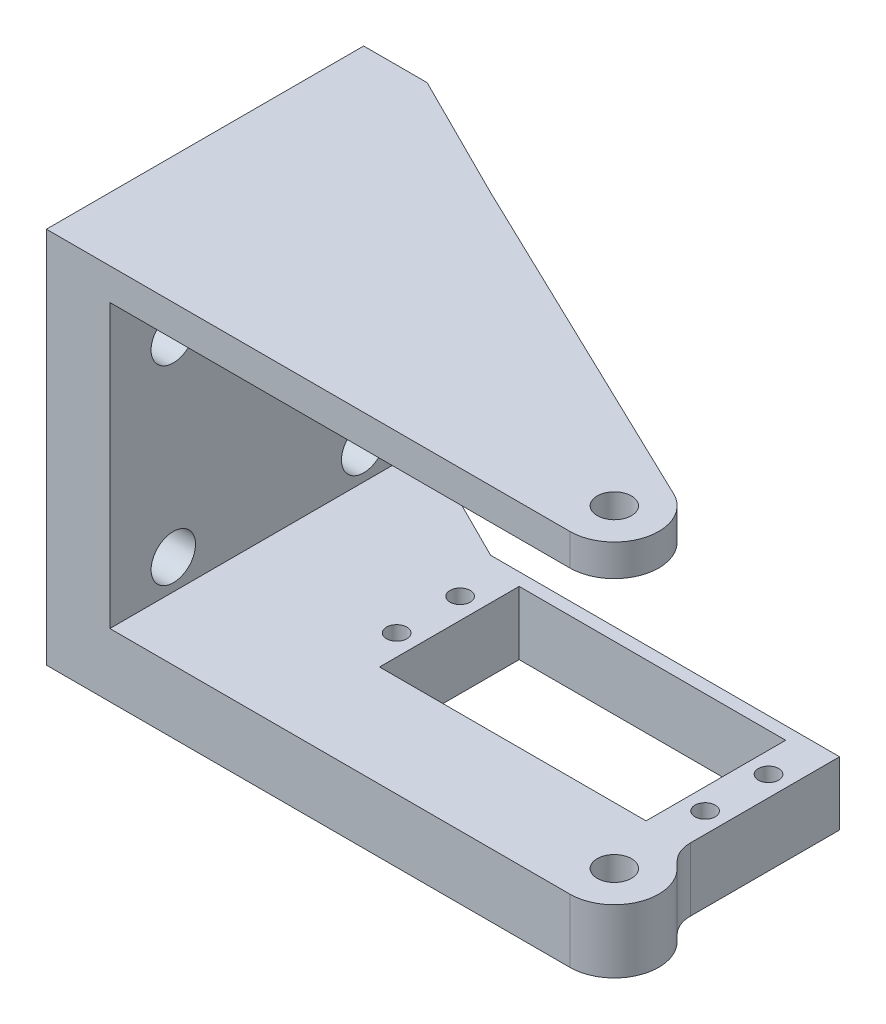
ISO-10303-21;
HEADER;
FILE_DESCRIPTION(('STEP AP214'),'2;1');
FILE_NAME('part.step','',(''),(''),'','','');
FILE_SCHEMA(('AUTOMOTIVE_DESIGN { 1 0 10303 214 1 1 1 1 }'));
ENDSEC;
DATA;
#1=APPLICATION_CONTEXT('core data for automotive mechanical design processes');
#2=APPLICATION_PROTOCOL_DEFINITION('international standard','automotive_design',2000,#1);
#3=PRODUCT_CONTEXT('',#1,'mechanical');
#4=PRODUCT('Part','Part','',(#3));
#5=PRODUCT_RELATED_PRODUCT_CATEGORY('part','',(#4));
#6=PRODUCT_DEFINITION_FORMATION('','',#4);
#7=PRODUCT_DEFINITION_CONTEXT('part definition',#1,'design');
#8=PRODUCT_DEFINITION('design','',#6,#7);
#9=PRODUCT_DEFINITION_SHAPE('','',#8);
#10=(LENGTH_UNIT() NAMED_UNIT(*) SI_UNIT(.MILLI.,.METRE.));
#11=(NAMED_UNIT(*) PLANE_ANGLE_UNIT() SI_UNIT($,.RADIAN.));
#12=(NAMED_UNIT(*) SI_UNIT($,.STERADIAN.) SOLID_ANGLE_UNIT());
#13=UNCERTAINTY_MEASURE_WITH_UNIT(LENGTH_MEASURE(1.E-05),#10,'distance_accuracy_value','');
#14=(GEOMETRIC_REPRESENTATION_CONTEXT(3) GLOBAL_UNCERTAINTY_ASSIGNED_CONTEXT((#13)) GLOBAL_UNIT_ASSIGNED_CONTEXT((#10,
#11,#12)) REPRESENTATION_CONTEXT('',''));
#15=CARTESIAN_POINT('',(0.,0.,0.));
#16=DIRECTION('',(0.,0.,1.));
#17=DIRECTION('',(1.,0.,0.));
#18=AXIS2_PLACEMENT_3D('',#15,#16,#17);
#19=CARTESIAN_POINT('',(4.94974746830584,-10.,-4.94974746830582));
#20=DIRECTION('',(0.707106781186549,0.,-0.707106781186546));
#21=DIRECTION('',(-0.707106781186546,0.,-0.707106781186549));
#22=AXIS2_PLACEMENT_3D('',#19,#20,#21);
#23=PLANE('',#22);
#24=DIRECTION('',(-0.707106781186546,0.,-0.707106781186549));
#25=VECTOR('',#24,1.);
#26=CARTESIAN_POINT('',(4.94974746830584,0.,-4.94974746830582));
#27=LINE('',#26,#25);
#28=CARTESIAN_POINT('',(4.94974746830584,0.,-4.94974746830583));
#29=VERTEX_POINT('',#28);
#30=CARTESIAN_POINT('',(3.96446609406726,0.,-5.93502884254441));
#31=VERTEX_POINT('',#30);
#32=EDGE_CURVE('E207',#29,#31,#27,.T.);
#33=ORIENTED_EDGE('',*,*,#32,.F.);
#34=DIRECTION('',(0.,1.,0.));
#35=VECTOR('',#34,1.);
#36=CARTESIAN_POINT('',(4.94974746830584,-10.,-4.94974746830583));
#37=LINE('',#36,#35);
#38=CARTESIAN_POINT('',(4.94974746830584,-10.,-4.94974746830583));
#39=VERTEX_POINT('',#38);
#40=EDGE_CURVE('E11',#39,#29,#37,.T.);
#41=ORIENTED_EDGE('',*,*,#40,.F.);
#42=DIRECTION('',(-0.707106781186546,0.,-0.707106781186549));
#43=VECTOR('',#42,1.);
#44=CARTESIAN_POINT('',(4.94974746830584,-10.,-4.94974746830582));
#45=LINE('',#44,#43);
#46=CARTESIAN_POINT('',(3.96446609406726,-10.,-5.93502884254441));
#47=VERTEX_POINT('',#46);
#48=EDGE_CURVE('E249',#39,#47,#45,.T.);
#49=ORIENTED_EDGE('',*,*,#48,.T.);
#50=DIRECTION('',(0.,1.,0.));
#51=VECTOR('',#50,1.);
#52=CARTESIAN_POINT('',(3.96446609406726,-10.,-5.93502884254441));
#53=LINE('',#52,#51);
#54=EDGE_CURVE('E167',#47,#31,#53,.T.);
#55=ORIENTED_EDGE('',*,*,#54,.T.);
#56=EDGE_LOOP('',(#33,#41,#49,#55));
#57=FACE_BOUND('',#56,.T.);
#58=ADVANCED_FACE('F41',(#57),#23,.T.);
#59=CARTESIAN_POINT('',(0.,-10.,0.));
#60=DIRECTION('',(0.,1.,0.));
#61=DIRECTION('',(0.,0.,1.));
#62=AXIS2_PLACEMENT_3D('',#59,#60,#61);
#63=CYLINDRICAL_SURFACE('',#62,7.);
#64=CARTESIAN_POINT('',(0.,0.,0.));
#65=DIRECTION('',(0.,1.,0.));
#66=DIRECTION('',(0.,0.,1.));
#67=AXIS2_PLACEMENT_3D('',#64,#65,#66);
#68=CIRCLE('',#67,7.);
#69=CARTESIAN_POINT('',(0.,0.,7.));
#70=VERTEX_POINT('',#69);
#71=EDGE_CURVE('E220',#70,#29,#68,.T.);
#72=ORIENTED_EDGE('',*,*,#71,.F.);
#73=DIRECTION('',(0.,1.,0.));
#74=VECTOR('',#73,1.);
#75=CARTESIAN_POINT('',(0.,-10.,7.));
#76=LINE('',#75,#74);
#77=CARTESIAN_POINT('',(0.,-10.,7.));
#78=VERTEX_POINT('',#77);
#79=EDGE_CURVE('E51',#78,#70,#76,.T.);
#80=ORIENTED_EDGE('',*,*,#79,.F.);
#81=CARTESIAN_POINT('',(0.,-10.,0.));
#82=DIRECTION('',(0.,1.,0.));
#83=DIRECTION('',(0.,0.,1.));
#84=AXIS2_PLACEMENT_3D('',#81,#82,#83);
#85=CIRCLE('',#84,7.);
#86=EDGE_CURVE('E176',#78,#39,#85,.T.);
#87=ORIENTED_EDGE('',*,*,#86,.T.);
#88=ORIENTED_EDGE('',*,*,#40,.T.);
#89=EDGE_LOOP('',(#72,#80,#87,#88));
#90=FACE_BOUND('',#89,.T.);
#91=ADVANCED_FACE('F434',(#90),#63,.T.);
#92=CARTESIAN_POINT('',(0.,-10.,7.));
#93=DIRECTION('',(0.,0.,-1.));
#94=DIRECTION('',(-1.,0.,0.));
#95=AXIS2_PLACEMENT_3D('',#92,#93,#94);
#96=PLANE('',#95);
#97=DIRECTION('',(-1.,0.,0.));
#98=VECTOR('',#97,1.);
#99=CARTESIAN_POINT('',(0.,0.,7.));
#100=LINE('',#99,#98);
#101=CARTESIAN_POINT('',(-72.5,0.,7.00000000000001));
#102=VERTEX_POINT('',#101);
#103=EDGE_CURVE('E218',#70,#102,#100,.T.);
#104=ORIENTED_EDGE('',*,*,#103,.T.);
#105=DIRECTION('',(0.,1.,0.));
#106=VECTOR('',#105,1.);
#107=CARTESIAN_POINT('',(-72.5,-60.9901951359279,7.00000000000001));
#108=LINE('',#107,#106);
#109=CARTESIAN_POINT('',(-72.5,44.5,7.00000000000001));
#110=VERTEX_POINT('',#109);
#111=EDGE_CURVE('E278',#102,#110,#108,.T.);
#112=ORIENTED_EDGE('',*,*,#111,.T.);
#113=DIRECTION('',(-1.,0.,0.));
#114=VECTOR('',#113,1.);
#115=CARTESIAN_POINT('',(-400028.25,44.5,7.000000000005));
#116=LINE('',#115,#114);
#117=CARTESIAN_POINT('',(0.,44.5,7.00000000001558));
#118=VERTEX_POINT('',#117);
#119=EDGE_CURVE('E348',#118,#110,#116,.T.);
#120=ORIENTED_EDGE('',*,*,#119,.F.);
#121=DIRECTION('',(0.,-1.,0.));
#122=VECTOR('',#121,1.);
#123=CARTESIAN_POINT('',(0.,49.5,7.00000000001558));
#124=LINE('',#123,#122);
#125=CARTESIAN_POINT('',(0.,49.5,7.00000000001558));
#126=VERTEX_POINT('',#125);
#127=EDGE_CURVE('E374',#126,#118,#124,.T.);
#128=ORIENTED_EDGE('',*,*,#127,.F.);
#129=DIRECTION('',(-1.,0.,0.));
#130=VECTOR('',#129,1.);
#131=CARTESIAN_POINT('',(-400028.25,49.5,7.00000000006185));
#132=LINE('',#131,#130);
#133=CARTESIAN_POINT('',(-82.4999999999818,49.5,7.000000000005));
#134=VERTEX_POINT('',#133);
#135=EDGE_CURVE('E283',#126,#134,#132,.T.);
#136=ORIENTED_EDGE('',*,*,#135,.T.);
#137=DIRECTION('',(0.,1.,0.));
#138=VECTOR('',#137,1.);
#139=CARTESIAN_POINT('',(-82.5,-60.9901951359279,7.00000000000001));
#140=LINE('',#139,#138);
#141=CARTESIAN_POINT('',(-82.5,-10.,7.00000000000001));
#142=VERTEX_POINT('',#141);
#143=EDGE_CURVE('E274',#142,#134,#140,.T.);
#144=ORIENTED_EDGE('',*,*,#143,.F.);
#145=DIRECTION('',(-1.,0.,0.));
#146=VECTOR('',#145,1.);
#147=CARTESIAN_POINT('',(0.,-10.,7.));
#148=LINE('',#147,#146);
#149=EDGE_CURVE('E139',#78,#142,#148,.T.);
#150=ORIENTED_EDGE('',*,*,#149,.F.);
#151=ORIENTED_EDGE('',*,*,#79,.T.);
#152=EDGE_LOOP('',(#104,#112,#120,#128,#136,#144,#150,#151));
#153=FACE_BOUND('',#152,.T.);
#154=ADVANCED_FACE('F280',(#153),#96,.F.);
#155=CARTESIAN_POINT('',(0.,-10.,-33.));
#156=DIRECTION('',(0.,0.,-1.));
#157=DIRECTION('',(-1.,0.,0.));
#158=AXIS2_PLACEMENT_3D('',#155,#156,#157);
#159=PLANE('',#158);
#160=DIRECTION('',(-1.,0.,0.));
#161=VECTOR('',#160,1.);
#162=CARTESIAN_POINT('',(0.,0.,-33.));
#163=LINE('',#162,#161);
#164=CARTESIAN_POINT('',(2.5,0.,-33.));
#165=VERTEX_POINT('',#164);
#166=CARTESIAN_POINT('',(-52.5,0.,-33.));
#167=VERTEX_POINT('',#166);
#168=EDGE_CURVE('E216',#165,#167,#163,.T.);
#169=ORIENTED_EDGE('',*,*,#168,.F.);
#170=DIRECTION('',(0.,1.,0.));
#171=VECTOR('',#170,1.);
#172=CARTESIAN_POINT('',(2.5,-10.,-33.));
#173=LINE('',#172,#171);
#174=CARTESIAN_POINT('',(2.5,-10.,-33.));
#175=VERTEX_POINT('',#174);
#176=EDGE_CURVE('E135',#175,#165,#173,.T.);
#177=ORIENTED_EDGE('',*,*,#176,.F.);
#178=DIRECTION('',(-1.,0.,0.));
#179=VECTOR('',#178,1.);
#180=CARTESIAN_POINT('',(0.,-10.,-33.));
#181=LINE('',#180,#179);
#182=CARTESIAN_POINT('',(-52.5,-10.,-33.));
#183=VERTEX_POINT('',#182);
#184=EDGE_CURVE('E128',#175,#183,#181,.T.);
#185=ORIENTED_EDGE('',*,*,#184,.T.);
#186=DIRECTION('',(0.,1.,0.));
#187=VECTOR('',#186,1.);
#188=CARTESIAN_POINT('',(-52.5,-10.,-33.));
#189=LINE('',#188,#187);
#190=EDGE_CURVE('E133',#183,#167,#189,.T.);
#191=ORIENTED_EDGE('',*,*,#190,.T.);
#192=EDGE_LOOP('',(#169,#177,#185,#191));
#193=FACE_BOUND('',#192,.T.);
#194=ADVANCED_FACE('F131',(#193),#159,.T.);
#195=CARTESIAN_POINT('',(2.5,-10.,0.));
#196=DIRECTION('',(1.,0.,0.));
#197=DIRECTION('',(0.,0.,-1.));
#198=AXIS2_PLACEMENT_3D('',#195,#196,#197);
#199=PLANE('',#198);
#200=DIRECTION('',(0.,0.,-1.));
#201=VECTOR('',#200,1.);
#202=CARTESIAN_POINT('',(2.5,0.,0.));
#203=LINE('',#202,#201);
#204=CARTESIAN_POINT('',(2.5,0.,-9.47056274847714));
#205=VERTEX_POINT('',#204);
#206=EDGE_CURVE('E213',#205,#165,#203,.T.);
#207=ORIENTED_EDGE('',*,*,#206,.F.);
#208=DIRECTION('',(0.,1.,0.));
#209=VECTOR('',#208,1.);
#210=CARTESIAN_POINT('',(2.5,-10.,-9.47056274847714));
#211=LINE('',#210,#209);
#212=CARTESIAN_POINT('',(2.5,-10.,-9.47056274847714));
#213=VERTEX_POINT('',#212);
#214=EDGE_CURVE('E163',#213,#205,#211,.T.);
#215=ORIENTED_EDGE('',*,*,#214,.F.);
#216=DIRECTION('',(0.,0.,-1.));
#217=VECTOR('',#216,1.);
#218=CARTESIAN_POINT('',(2.5,-10.,0.));
#219=LINE('',#218,#217);
#220=EDGE_CURVE('E140',#213,#175,#219,.T.);
#221=ORIENTED_EDGE('',*,*,#220,.T.);
#222=ORIENTED_EDGE('',*,*,#176,.T.);
#223=EDGE_LOOP('',(#207,#215,#221,#222));
#224=FACE_BOUND('',#223,.T.);
#225=ADVANCED_FACE('F256',(#224),#199,.T.);
#226=CARTESIAN_POINT('',(0.,-10.,-31.));
#227=DIRECTION('',(0.,0.,1.));
#228=DIRECTION('',(1.,0.,0.));
#229=AXIS2_PLACEMENT_3D('',#226,#227,#228);
#230=PLANE('',#229);
#231=DIRECTION('',(1.,0.,0.));
#232=VECTOR('',#231,1.);
#233=CARTESIAN_POINT('',(0.,0.,-31.));
#234=LINE('',#233,#232);
#235=CARTESIAN_POINT('',(-46.,0.,-31.));
#236=VERTEX_POINT('',#235);
#237=CARTESIAN_POINT('',(-4.,0.,-31.));
#238=VERTEX_POINT('',#237);
#239=EDGE_CURVE('E196',#236,#238,#234,.T.);
#240=ORIENTED_EDGE('',*,*,#239,.F.);
#241=DIRECTION('',(0.,1.,0.));
#242=VECTOR('',#241,1.);
#243=CARTESIAN_POINT('',(-46.,-10.,-31.));
#244=LINE('',#243,#242);
#245=CARTESIAN_POINT('',(-46.,-10.,-31.));
#246=VERTEX_POINT('',#245);
#247=EDGE_CURVE('E169',#246,#236,#244,.T.);
#248=ORIENTED_EDGE('',*,*,#247,.F.);
#249=DIRECTION('',(1.,0.,0.));
#250=VECTOR('',#249,1.);
#251=CARTESIAN_POINT('',(0.,-10.,-31.));
#252=LINE('',#251,#250);
#253=CARTESIAN_POINT('',(-4.,-10.,-31.));
#254=VERTEX_POINT('',#253);
#255=EDGE_CURVE('E240',#246,#254,#252,.T.);
#256=ORIENTED_EDGE('',*,*,#255,.T.);
#257=DIRECTION('',(0.,1.,0.));
#258=VECTOR('',#257,1.);
#259=CARTESIAN_POINT('',(-4.,-10.,-31.));
#260=LINE('',#259,#258);
#261=EDGE_CURVE('E45',#254,#238,#260,.T.);
#262=ORIENTED_EDGE('',*,*,#261,.T.);
#263=EDGE_LOOP('',(#240,#248,#256,#262));
#264=FACE_BOUND('',#263,.T.);
#265=ADVANCED_FACE('F449',(#264),#230,.T.);
#266=CARTESIAN_POINT('',(-46.,-10.,0.));
#267=DIRECTION('',(-1.,0.,0.));
#268=DIRECTION('',(0.,0.,1.));
#269=AXIS2_PLACEMENT_3D('',#266,#267,#268);
#270=PLANE('',#269);
#271=DIRECTION('',(0.,0.,1.));
#272=VECTOR('',#271,1.);
#273=CARTESIAN_POINT('',(-46.,0.,0.));
#274=LINE('',#273,#272);
#275=CARTESIAN_POINT('',(-46.,0.,-9.));
#276=VERTEX_POINT('',#275);
#277=EDGE_CURVE('E204',#236,#276,#274,.T.);
#278=ORIENTED_EDGE('',*,*,#277,.T.);
#279=DIRECTION('',(0.,1.,0.));
#280=VECTOR('',#279,1.);
#281=CARTESIAN_POINT('',(-46.,-10.,-9.));
#282=LINE('',#281,#280);
#283=CARTESIAN_POINT('',(-46.,-10.,-9.));
#284=VERTEX_POINT('',#283);
#285=EDGE_CURVE('E171',#284,#276,#282,.T.);
#286=ORIENTED_EDGE('',*,*,#285,.F.);
#287=DIRECTION('',(0.,0.,1.));
#288=VECTOR('',#287,1.);
#289=CARTESIAN_POINT('',(-46.,-10.,0.));
#290=LINE('',#289,#288);
#291=EDGE_CURVE('E246',#246,#284,#290,.T.);
#292=ORIENTED_EDGE('',*,*,#291,.F.);
#293=ORIENTED_EDGE('',*,*,#247,.T.);
#294=EDGE_LOOP('',(#278,#286,#292,#293));
#295=FACE_BOUND('',#294,.T.);
#296=ADVANCED_FACE('F452',(#295),#270,.F.);
#297=CARTESIAN_POINT('',(0.,-10.,-9.));
#298=DIRECTION('',(0.,0.,1.));
#299=DIRECTION('',(1.,0.,0.));
#300=AXIS2_PLACEMENT_3D('',#297,#298,#299);
#301=PLANE('',#300);
#302=DIRECTION('',(1.,0.,0.));
#303=VECTOR('',#302,1.);
#304=CARTESIAN_POINT('',(0.,0.,-9.));
#305=LINE('',#304,#303);
#306=CARTESIAN_POINT('',(-4.,0.,-9.));
#307=VERTEX_POINT('',#306);
#308=EDGE_CURVE('E202',#276,#307,#305,.T.);
#309=ORIENTED_EDGE('',*,*,#308,.T.);
#310=DIRECTION('',(0.,1.,0.));
#311=VECTOR('',#310,1.);
#312=CARTESIAN_POINT('',(-4.,-10.,-9.));
#313=LINE('',#312,#311);
#314=CARTESIAN_POINT('',(-4.,-10.,-9.));
#315=VERTEX_POINT('',#314);
#316=EDGE_CURVE('E173',#315,#307,#313,.T.);
#317=ORIENTED_EDGE('',*,*,#316,.F.);
#318=DIRECTION('',(1.,0.,0.));
#319=VECTOR('',#318,1.);
#320=CARTESIAN_POINT('',(0.,-10.,-9.));
#321=LINE('',#320,#319);
#322=EDGE_CURVE('E244',#284,#315,#321,.T.);
#323=ORIENTED_EDGE('',*,*,#322,.F.);
#324=ORIENTED_EDGE('',*,*,#285,.T.);
#325=EDGE_LOOP('',(#309,#317,#323,#324));
#326=FACE_BOUND('',#325,.T.);
#327=ADVANCED_FACE('F455',(#326),#301,.F.);
#328=CARTESIAN_POINT('',(-3.99999999999999,-10.,0.));
#329=DIRECTION('',(-1.,0.,0.));
#330=DIRECTION('',(0.,0.,1.));
#331=AXIS2_PLACEMENT_3D('',#328,#329,#330);
#332=PLANE('',#331);
#333=DIRECTION('',(0.,0.,1.));
#334=VECTOR('',#333,1.);
#335=CARTESIAN_POINT('',(-3.99999999999999,0.,0.));
#336=LINE('',#335,#334);
#337=EDGE_CURVE('E199',#238,#307,#336,.T.);
#338=ORIENTED_EDGE('',*,*,#337,.F.);
#339=ORIENTED_EDGE('',*,*,#261,.F.);
#340=DIRECTION('',(0.,0.,1.));
#341=VECTOR('',#340,1.);
#342=CARTESIAN_POINT('',(-3.99999999999999,-10.,0.));
#343=LINE('',#342,#341);
#344=EDGE_CURVE('E242',#254,#315,#343,.T.);
#345=ORIENTED_EDGE('',*,*,#344,.T.);
#346=ORIENTED_EDGE('',*,*,#316,.T.);
#347=EDGE_LOOP('',(#338,#339,#345,#346));
#348=FACE_BOUND('',#347,.T.);
#349=ADVANCED_FACE('F459',(#348),#332,.T.);
#350=CARTESIAN_POINT('',(-0.699999999999998,-10.,-25.));
#351=DIRECTION('',(0.,1.,0.));
#352=DIRECTION('',(0.,0.,1.));
#353=AXIS2_PLACEMENT_3D('',#350,#351,#352);
#354=CYLINDRICAL_SURFACE('',#353,1.6);
#355=CARTESIAN_POINT('',(-0.699999999999998,-10.,-25.));
#356=DIRECTION('',(0.,1.,0.));
#357=DIRECTION('',(0.,0.,1.));
#358=AXIS2_PLACEMENT_3D('',#355,#356,#357);
#359=CIRCLE('',#358,1.6);
#360=CARTESIAN_POINT('',(-0.699999999999998,-10.,-23.4));
#361=VERTEX_POINT('',#360);
#362=EDGE_CURVE('E237',#361,#361,#359,.T.);
#363=ORIENTED_EDGE('',*,*,#362,.F.);
#364=EDGE_LOOP('',(#363));
#365=FACE_BOUND('',#364,.T.);
#366=CARTESIAN_POINT('',(-0.699999999999998,0.,-25.));
#367=DIRECTION('',(0.,1.,0.));
#368=DIRECTION('',(0.,0.,1.));
#369=AXIS2_PLACEMENT_3D('',#366,#367,#368);
#370=CIRCLE('',#369,1.6);
#371=CARTESIAN_POINT('',(-0.699999999999998,0.,-23.4));
#372=VERTEX_POINT('',#371);
#373=EDGE_CURVE('E193',#372,#372,#370,.T.);
#374=ORIENTED_EDGE('',*,*,#373,.T.);
#375=EDGE_LOOP('',(#374));
#376=FACE_BOUND('',#375,.T.);
#377=ADVANCED_FACE('F463',(#365,#376),#354,.F.);
#378=CARTESIAN_POINT('',(-0.699999999999994,-10.,-15.));
#379=DIRECTION('',(0.,1.,0.));
#380=DIRECTION('',(0.,0.,1.));
#381=AXIS2_PLACEMENT_3D('',#378,#379,#380);
#382=CYLINDRICAL_SURFACE('',#381,1.6);
#383=CARTESIAN_POINT('',(-0.699999999999994,-10.,-15.));
#384=DIRECTION('',(0.,1.,0.));
#385=DIRECTION('',(0.,0.,1.));
#386=AXIS2_PLACEMENT_3D('',#383,#384,#385);
#387=CIRCLE('',#386,1.6);
#388=CARTESIAN_POINT('',(-0.699999999999994,-10.,-13.4));
#389=VERTEX_POINT('',#388);
#390=EDGE_CURVE('E230',#389,#389,#387,.T.);
#391=ORIENTED_EDGE('',*,*,#390,.F.);
#392=EDGE_LOOP('',(#391));
#393=FACE_BOUND('',#392,.T.);
#394=CARTESIAN_POINT('',(-0.699999999999994,0.,-15.));
#395=DIRECTION('',(0.,1.,0.));
#396=DIRECTION('',(0.,0.,1.));
#397=AXIS2_PLACEMENT_3D('',#394,#395,#396);
#398=CIRCLE('',#397,1.6);
#399=CARTESIAN_POINT('',(-0.699999999999994,0.,-13.4));
#400=VERTEX_POINT('',#399);
#401=EDGE_CURVE('E190',#400,#400,#398,.T.);
#402=ORIENTED_EDGE('',*,*,#401,.T.);
#403=EDGE_LOOP('',(#402));
#404=FACE_BOUND('',#403,.T.);
#405=ADVANCED_FACE('F468',(#393,#404),#382,.F.);
#406=CARTESIAN_POINT('',(-49.3,-10.,-15.));
#407=DIRECTION('',(0.,1.,0.));
#408=DIRECTION('',(0.,0.,1.));
#409=AXIS2_PLACEMENT_3D('',#406,#407,#408);
#410=CYLINDRICAL_SURFACE('',#409,1.6);
#411=CARTESIAN_POINT('',(-49.3,-10.,-15.));
#412=DIRECTION('',(0.,1.,0.));
#413=DIRECTION('',(0.,0.,1.));
#414=AXIS2_PLACEMENT_3D('',#411,#412,#413);
#415=CIRCLE('',#414,1.6);
#416=CARTESIAN_POINT('',(-49.3,-10.,-13.4));
#417=VERTEX_POINT('',#416);
#418=EDGE_CURVE('E225',#417,#417,#415,.T.);
#419=ORIENTED_EDGE('',*,*,#418,.F.);
#420=EDGE_LOOP('',(#419));
#421=FACE_BOUND('',#420,.T.);
#422=CARTESIAN_POINT('',(-49.3,0.,-15.));
#423=DIRECTION('',(0.,1.,0.));
#424=DIRECTION('',(0.,0.,1.));
#425=AXIS2_PLACEMENT_3D('',#422,#423,#424);
#426=CIRCLE('',#425,1.6);
#427=CARTESIAN_POINT('',(-49.3,0.,-13.4));
#428=VERTEX_POINT('',#427);
#429=EDGE_CURVE('E187',#428,#428,#426,.T.);
#430=ORIENTED_EDGE('',*,*,#429,.T.);
#431=EDGE_LOOP('',(#430));
#432=FACE_BOUND('',#431,.T.);
#433=ADVANCED_FACE('F471',(#421,#432),#410,.F.);
#434=CARTESIAN_POINT('',(-49.3,-10.,-25.));
#435=DIRECTION('',(0.,1.,0.));
#436=DIRECTION('',(0.,0.,1.));
#437=AXIS2_PLACEMENT_3D('',#434,#435,#436);
#438=CYLINDRICAL_SURFACE('',#437,1.6);
#439=CARTESIAN_POINT('',(-49.3,-10.,-25.));
#440=DIRECTION('',(0.,1.,0.));
#441=DIRECTION('',(0.,0.,1.));
#442=AXIS2_PLACEMENT_3D('',#439,#440,#441);
#443=CIRCLE('',#442,1.6);
#444=CARTESIAN_POINT('',(-49.3,-10.,-23.4));
#445=VERTEX_POINT('',#444);
#446=EDGE_CURVE('E222',#445,#445,#443,.T.);
#447=ORIENTED_EDGE('',*,*,#446,.F.);
#448=EDGE_LOOP('',(#447));
#449=FACE_BOUND('',#448,.T.);
#450=CARTESIAN_POINT('',(-49.3,0.,-25.));
#451=DIRECTION('',(0.,1.,0.));
#452=DIRECTION('',(0.,0.,1.));
#453=AXIS2_PLACEMENT_3D('',#450,#451,#452);
#454=CIRCLE('',#453,1.6);
#455=CARTESIAN_POINT('',(-49.3,0.,-23.4));
#456=VERTEX_POINT('',#455);
#457=EDGE_CURVE('E154',#456,#456,#454,.T.);
#458=ORIENTED_EDGE('',*,*,#457,.T.);
#459=EDGE_LOOP('',(#458));
#460=FACE_BOUND('',#459,.T.);
#461=ADVANCED_FACE('F43',(#449,#460),#438,.F.);
#462=CARTESIAN_POINT('',(7.5,-10.,-9.47056274847714));
#463=DIRECTION('',(0.,1.,0.));
#464=DIRECTION('',(0.,0.,1.));
#465=AXIS2_PLACEMENT_3D('',#462,#463,#464);
#466=CYLINDRICAL_SURFACE('',#465,5.);
#467=CARTESIAN_POINT('',(7.5,0.,-9.47056274847714));
#468=DIRECTION('',(0.,1.,0.));
#469=DIRECTION('',(0.,0.,1.));
#470=AXIS2_PLACEMENT_3D('',#467,#468,#469);
#471=CIRCLE('',#470,5.);
#472=EDGE_CURVE('E210',#31,#205,#471,.F.);
#473=ORIENTED_EDGE('',*,*,#472,.F.);
#474=ORIENTED_EDGE('',*,*,#54,.F.);
#475=CARTESIAN_POINT('',(7.5,-10.,-9.47056274847714));
#476=DIRECTION('',(0.,1.,0.));
#477=DIRECTION('',(0.,0.,1.));
#478=AXIS2_PLACEMENT_3D('',#475,#476,#477);
#479=CIRCLE('',#478,5.);
#480=EDGE_CURVE('E251',#47,#213,#479,.F.);
#481=ORIENTED_EDGE('',*,*,#480,.T.);
#482=ORIENTED_EDGE('',*,*,#214,.T.);
#483=EDGE_LOOP('',(#473,#474,#481,#482));
#484=FACE_BOUND('',#483,.T.);
#485=ADVANCED_FACE('F260',(#484),#466,.F.);
#486=CARTESIAN_POINT('',(0.,-10.,0.));
#487=DIRECTION('',(0.,1.,0.));
#488=DIRECTION('',(0.,0.,1.));
#489=AXIS2_PLACEMENT_3D('',#486,#487,#488);
#490=PLANE('',#489);
#491=ORIENTED_EDGE('',*,*,#446,.T.);
#492=EDGE_LOOP('',(#491));
#493=FACE_BOUND('',#492,.T.);
#494=ORIENTED_EDGE('',*,*,#418,.T.);
#495=EDGE_LOOP('',(#494));
#496=FACE_BOUND('',#495,.T.);
#497=ORIENTED_EDGE('',*,*,#390,.T.);
#498=EDGE_LOOP('',(#497));
#499=FACE_BOUND('',#498,.T.);
#500=ORIENTED_EDGE('',*,*,#362,.T.);
#501=EDGE_LOOP('',(#500));
#502=FACE_BOUND('',#501,.T.);
#503=ORIENTED_EDGE('',*,*,#255,.F.);
#504=ORIENTED_EDGE('',*,*,#291,.T.);
#505=ORIENTED_EDGE('',*,*,#322,.T.);
#506=ORIENTED_EDGE('',*,*,#344,.F.);
#507=EDGE_LOOP('',(#503,#504,#505,#506));
#508=FACE_BOUND('',#507,.T.);
#509=ORIENTED_EDGE('',*,*,#48,.F.);
#510=ORIENTED_EDGE('',*,*,#86,.F.);
#511=ORIENTED_EDGE('',*,*,#149,.T.);
#512=DIRECTION('',(0.,0.,-1.));
#513=VECTOR('',#512,1.);
#514=CARTESIAN_POINT('',(-82.5,-10.,0.));
#515=LINE('',#514,#513);
#516=CARTESIAN_POINT('',(-82.5,-10.,-43.));
#517=VERTEX_POINT('',#516);
#518=EDGE_CURVE('E264',#142,#517,#515,.T.);
#519=ORIENTED_EDGE('',*,*,#518,.T.);
#520=DIRECTION('',(1.,0.,0.));
#521=VECTOR('',#520,1.);
#522=CARTESIAN_POINT('',(0.,-10.,-43.));
#523=LINE('',#522,#521);
#524=CARTESIAN_POINT('',(-72.5,-10.,-43.));
#525=VERTEX_POINT('',#524);
#526=EDGE_CURVE('E150',#517,#525,#523,.T.);
#527=ORIENTED_EDGE('',*,*,#526,.T.);
#528=DIRECTION('',(-0.894427190999916,0.,-0.447213595499958));
#529=VECTOR('',#528,1.);
#530=CARTESIAN_POINT('',(2.7,-10.,-5.4));
#531=LINE('',#530,#529);
#532=EDGE_CURVE('E144',#183,#525,#531,.T.);
#533=ORIENTED_EDGE('',*,*,#532,.F.);
#534=ORIENTED_EDGE('',*,*,#184,.F.);
#535=ORIENTED_EDGE('',*,*,#220,.F.);
#536=ORIENTED_EDGE('',*,*,#480,.F.);
#537=EDGE_LOOP('',(#509,#510,#511,#519,#527,#533,#534,#535,#536));
#538=FACE_BOUND('',#537,.T.);
#539=CARTESIAN_POINT('',(0.,-10.,0.));
#540=DIRECTION('',(0.,1.,0.));
#541=DIRECTION('',(0.,0.,1.));
#542=AXIS2_PLACEMENT_3D('',#539,#540,#541);
#543=CIRCLE('',#542,2.7);
#544=CARTESIAN_POINT('',(0.,-10.,2.7));
#545=VERTEX_POINT('',#544);
#546=EDGE_CURVE('E309',#545,#545,#543,.F.);
#547=ORIENTED_EDGE('',*,*,#546,.F.);
#548=EDGE_LOOP('',(#547));
#549=FACE_BOUND('',#548,.T.);
#550=ADVANCED_FACE('F145',(#493,#496,#499,#502,#508,#538,#549),#490,.F.);
#551=CARTESIAN_POINT('',(0.,0.,0.));
#552=DIRECTION('',(0.,1.,0.));
#553=DIRECTION('',(0.,0.,1.));
#554=AXIS2_PLACEMENT_3D('',#551,#552,#553);
#555=PLANE('',#554);
#556=ORIENTED_EDGE('',*,*,#457,.F.);
#557=EDGE_LOOP('',(#556));
#558=FACE_BOUND('',#557,.T.);
#559=ORIENTED_EDGE('',*,*,#429,.F.);
#560=EDGE_LOOP('',(#559));
#561=FACE_BOUND('',#560,.T.);
#562=ORIENTED_EDGE('',*,*,#401,.F.);
#563=EDGE_LOOP('',(#562));
#564=FACE_BOUND('',#563,.T.);
#565=ORIENTED_EDGE('',*,*,#373,.F.);
#566=EDGE_LOOP('',(#565));
#567=FACE_BOUND('',#566,.T.);
#568=ORIENTED_EDGE('',*,*,#239,.T.);
#569=ORIENTED_EDGE('',*,*,#337,.T.);
#570=ORIENTED_EDGE('',*,*,#308,.F.);
#571=ORIENTED_EDGE('',*,*,#277,.F.);
#572=EDGE_LOOP('',(#568,#569,#570,#571));
#573=FACE_BOUND('',#572,.T.);
#574=ORIENTED_EDGE('',*,*,#32,.T.);
#575=ORIENTED_EDGE('',*,*,#472,.T.);
#576=ORIENTED_EDGE('',*,*,#206,.T.);
#577=ORIENTED_EDGE('',*,*,#168,.T.);
#578=DIRECTION('',(0.894427190999916,0.,0.447213595499958));
#579=VECTOR('',#578,1.);
#580=CARTESIAN_POINT('',(2.7,0.,-5.4));
#581=LINE('',#580,#579);
#582=CARTESIAN_POINT('',(-72.5,0.,-43.));
#583=VERTEX_POINT('',#582);
#584=EDGE_CURVE('E160',#583,#167,#581,.T.);
#585=ORIENTED_EDGE('',*,*,#584,.F.);
#586=DIRECTION('',(0.,0.,1.));
#587=VECTOR('',#586,1.);
#588=CARTESIAN_POINT('',(-72.5,0.,0.));
#589=LINE('',#588,#587);
#590=EDGE_CURVE('E295',#583,#102,#589,.T.);
#591=ORIENTED_EDGE('',*,*,#590,.T.);
#592=ORIENTED_EDGE('',*,*,#103,.F.);
#593=ORIENTED_EDGE('',*,*,#71,.T.);
#594=EDGE_LOOP('',(#574,#575,#576,#577,#585,#591,#592,#593));
#595=FACE_BOUND('',#594,.T.);
#596=CARTESIAN_POINT('',(0.,0.,0.));
#597=DIRECTION('',(0.,1.,0.));
#598=DIRECTION('',(0.,0.,1.));
#599=AXIS2_PLACEMENT_3D('',#596,#597,#598);
#600=CIRCLE('',#599,2.7);
#601=CARTESIAN_POINT('',(0.,0.,2.7));
#602=VERTEX_POINT('',#601);
#603=EDGE_CURVE('E307',#602,#602,#600,.T.);
#604=ORIENTED_EDGE('',*,*,#603,.F.);
#605=EDGE_LOOP('',(#604));
#606=FACE_BOUND('',#605,.T.);
#607=ADVANCED_FACE('F300',(#558,#561,#564,#567,#573,#595,#606),#555,.T.);
#608=CARTESIAN_POINT('',(2.7,-63.8516480713451,-5.4));
#609=DIRECTION('',(-0.447213595499958,0.,0.894427190999916));
#610=DIRECTION('',(0.894427190999916,0.,0.447213595499958));
#611=AXIS2_PLACEMENT_3D('',#608,#609,#610);
#612=PLANE('',#611);
#613=ORIENTED_EDGE('',*,*,#190,.F.);
#614=ORIENTED_EDGE('',*,*,#532,.T.);
#615=DIRECTION('',(0.,1.,0.));
#616=VECTOR('',#615,1.);
#617=CARTESIAN_POINT('',(-72.5,-63.8516480713451,-43.));
#618=LINE('',#617,#616);
#619=EDGE_CURVE('E155',#525,#583,#618,.T.);
#620=ORIENTED_EDGE('',*,*,#619,.T.);
#621=ORIENTED_EDGE('',*,*,#584,.T.);
#622=EDGE_LOOP('',(#613,#614,#620,#621));
#623=FACE_BOUND('',#622,.T.);
#624=ADVANCED_FACE('F158',(#623),#612,.F.);
#625=CARTESIAN_POINT('',(-72.5,-60.9901951359279,0.));
#626=DIRECTION('',(-1.,0.,0.));
#627=DIRECTION('',(0.,0.,1.));
#628=AXIS2_PLACEMENT_3D('',#625,#626,#627);
#629=PLANE('',#628);
#630=CARTESIAN_POINT('',(-72.5,34.75,-33.0000000000007));
#631=DIRECTION('',(-1.,0.,0.));
#632=DIRECTION('',(0.,0.,1.));
#633=AXIS2_PLACEMENT_3D('',#630,#631,#632);
#634=CIRCLE('',#633,3.5);
#635=CARTESIAN_POINT('',(-72.5,34.75,-29.5000000000007));
#636=VERTEX_POINT('',#635);
#637=EDGE_CURVE('E313',#636,#636,#634,.F.);
#638=ORIENTED_EDGE('',*,*,#637,.F.);
#639=EDGE_LOOP('',(#638));
#640=FACE_BOUND('',#639,.T.);
#641=CARTESIAN_POINT('',(-72.5,4.74999999999998,-33.0000000000006));
#642=DIRECTION('',(-1.,0.,0.));
#643=DIRECTION('',(0.,0.,1.));
#644=AXIS2_PLACEMENT_3D('',#641,#642,#643);
#645=CIRCLE('',#644,3.5);
#646=CARTESIAN_POINT('',(-72.5,4.74999999999998,-29.5000000000006));
#647=VERTEX_POINT('',#646);
#648=EDGE_CURVE('E328',#647,#647,#645,.F.);
#649=ORIENTED_EDGE('',*,*,#648,.F.);
#650=EDGE_LOOP('',(#649));
#651=FACE_BOUND('',#650,.T.);
#652=CARTESIAN_POINT('',(-72.5,4.75,-3.00000000000065));
#653=DIRECTION('',(-1.,0.,0.));
#654=DIRECTION('',(0.,0.,1.));
#655=AXIS2_PLACEMENT_3D('',#652,#653,#654);
#656=CIRCLE('',#655,3.5);
#657=CARTESIAN_POINT('',(-72.5,4.75,0.499999999999348));
#658=VERTEX_POINT('',#657);
#659=EDGE_CURVE('E320',#658,#658,#656,.F.);
#660=ORIENTED_EDGE('',*,*,#659,.F.);
#661=EDGE_LOOP('',(#660));
#662=FACE_BOUND('',#661,.T.);
#663=CARTESIAN_POINT('',(-72.5,34.75,-3.00000000000067));
#664=DIRECTION('',(-1.,0.,0.));
#665=DIRECTION('',(0.,0.,1.));
#666=AXIS2_PLACEMENT_3D('',#663,#664,#665);
#667=CIRCLE('',#666,3.5);
#668=CARTESIAN_POINT('',(-72.5,34.75,0.499999999999332));
#669=VERTEX_POINT('',#668);
#670=EDGE_CURVE('E340',#669,#669,#667,.F.);
#671=ORIENTED_EDGE('',*,*,#670,.F.);
#672=EDGE_LOOP('',(#671));
#673=FACE_BOUND('',#672,.T.);
#674=ORIENTED_EDGE('',*,*,#590,.F.);
#675=DIRECTION('',(0.,1.,0.));
#676=VECTOR('',#675,1.);
#677=CARTESIAN_POINT('',(-72.5,-60.9901951359279,-43.));
#678=LINE('',#677,#676);
#679=CARTESIAN_POINT('',(-72.4999999999341,44.5,-43.0000000000064));
#680=VERTEX_POINT('',#679);
#681=EDGE_CURVE('E288',#583,#680,#678,.T.);
#682=ORIENTED_EDGE('',*,*,#681,.T.);
#683=DIRECTION('',(0.,0.,1.));
#684=VECTOR('',#683,1.);
#685=CARTESIAN_POINT('',(-72.5,44.5,0.));
#686=LINE('',#685,#684);
#687=EDGE_CURVE('E293',#680,#110,#686,.T.);
#688=ORIENTED_EDGE('',*,*,#687,.T.);
#689=ORIENTED_EDGE('',*,*,#111,.F.);
#690=EDGE_LOOP('',(#674,#682,#688,#689));
#691=FACE_BOUND('',#690,.T.);
#692=ADVANCED_FACE('F387',(#640,#651,#662,#673,#691),#629,.F.);
#693=CARTESIAN_POINT('',(-82.5,-60.9901951359279,0.));
#694=DIRECTION('',(-1.,0.,0.));
#695=DIRECTION('',(0.,0.,1.));
#696=AXIS2_PLACEMENT_3D('',#693,#694,#695);
#697=PLANE('',#696);
#698=CARTESIAN_POINT('',(-82.5,34.75,-33.0000000000007));
#699=DIRECTION('',(-1.,0.,0.));
#700=DIRECTION('',(0.,0.,1.));
#701=AXIS2_PLACEMENT_3D('',#698,#699,#700);
#702=CIRCLE('',#701,3.5);
#703=CARTESIAN_POINT('',(-82.5,34.75,-29.5000000000007));
#704=VERTEX_POINT('',#703);
#705=EDGE_CURVE('E331',#704,#704,#702,.T.);
#706=ORIENTED_EDGE('',*,*,#705,.F.);
#707=EDGE_LOOP('',(#706));
#708=FACE_BOUND('',#707,.T.);
#709=CARTESIAN_POINT('',(-82.5,4.74999999999998,-33.0000000000006));
#710=DIRECTION('',(-1.,0.,0.));
#711=DIRECTION('',(0.,0.,1.));
#712=AXIS2_PLACEMENT_3D('',#709,#710,#711);
#713=CIRCLE('',#712,3.5);
#714=CARTESIAN_POINT('',(-82.5,4.74999999999998,-29.5000000000006));
#715=VERTEX_POINT('',#714);
#716=EDGE_CURVE('E324',#715,#715,#713,.T.);
#717=ORIENTED_EDGE('',*,*,#716,.F.);
#718=EDGE_LOOP('',(#717));
#719=FACE_BOUND('',#718,.T.);
#720=CARTESIAN_POINT('',(-82.5,4.75,-3.00000000000065));
#721=DIRECTION('',(-1.,0.,0.));
#722=DIRECTION('',(0.,0.,1.));
#723=AXIS2_PLACEMENT_3D('',#720,#721,#722);
#724=CIRCLE('',#723,3.5);
#725=CARTESIAN_POINT('',(-82.5,4.75,0.499999999999348));
#726=VERTEX_POINT('',#725);
#727=EDGE_CURVE('E323',#726,#726,#724,.T.);
#728=ORIENTED_EDGE('',*,*,#727,.F.);
#729=EDGE_LOOP('',(#728));
#730=FACE_BOUND('',#729,.T.);
#731=CARTESIAN_POINT('',(-82.5,34.75,-3.00000000000067));
#732=DIRECTION('',(-1.,0.,0.));
#733=DIRECTION('',(0.,0.,1.));
#734=AXIS2_PLACEMENT_3D('',#731,#732,#733);
#735=CIRCLE('',#734,3.5);
#736=CARTESIAN_POINT('',(-82.5,34.75,0.499999999999332));
#737=VERTEX_POINT('',#736);
#738=EDGE_CURVE('E327',#737,#737,#735,.T.);
#739=ORIENTED_EDGE('',*,*,#738,.F.);
#740=EDGE_LOOP('',(#739));
#741=FACE_BOUND('',#740,.T.);
#742=ORIENTED_EDGE('',*,*,#518,.F.);
#743=ORIENTED_EDGE('',*,*,#143,.T.);
#744=DIRECTION('',(0.,0.,-1.));
#745=VECTOR('',#744,1.);
#746=CARTESIAN_POINT('',(-82.4999999999818,49.5,291591.8));
#747=LINE('',#746,#745);
#748=CARTESIAN_POINT('',(-82.4999999999818,49.5,-43.0000000000064));
#749=VERTEX_POINT('',#748);
#750=EDGE_CURVE('E355',#134,#749,#747,.T.);
#751=ORIENTED_EDGE('',*,*,#750,.T.);
#752=DIRECTION('',(0.,1.,0.));
#753=VECTOR('',#752,1.);
#754=CARTESIAN_POINT('',(-82.5,-60.9901951359279,-43.));
#755=LINE('',#754,#753);
#756=EDGE_CURVE('E277',#517,#749,#755,.T.);
#757=ORIENTED_EDGE('',*,*,#756,.F.);
#758=EDGE_LOOP('',(#742,#743,#751,#757));
#759=FACE_BOUND('',#758,.T.);
#760=ADVANCED_FACE('F271',(#708,#719,#730,#741,#759),#697,.T.);
#761=CARTESIAN_POINT('',(0.,-60.9901951359279,-43.));
#762=DIRECTION('',(0.,0.,-1.));
#763=DIRECTION('',(-1.,0.,0.));
#764=AXIS2_PLACEMENT_3D('',#761,#762,#763);
#765=PLANE('',#764);
#766=ORIENTED_EDGE('',*,*,#526,.F.);
#767=ORIENTED_EDGE('',*,*,#756,.T.);
#768=DIRECTION('',(1.,0.,0.));
#769=VECTOR('',#768,1.);
#770=CARTESIAN_POINT('',(-400028.25,49.5,-43.0000000000064));
#771=LINE('',#770,#769);
#772=CARTESIAN_POINT('',(-72.4999999999341,49.5,-43.0000000000064));
#773=VERTEX_POINT('',#772);
#774=EDGE_CURVE('E357',#749,#773,#771,.T.);
#775=ORIENTED_EDGE('',*,*,#774,.T.);
#776=DIRECTION('',(0.,-1.,0.));
#777=VECTOR('',#776,1.);
#778=CARTESIAN_POINT('',(-72.4999999999341,49.5,-43.0000000000064));
#779=LINE('',#778,#777);
#780=EDGE_CURVE('E371',#773,#680,#779,.T.);
#781=ORIENTED_EDGE('',*,*,#780,.T.);
#782=ORIENTED_EDGE('',*,*,#681,.F.);
#783=ORIENTED_EDGE('',*,*,#619,.F.);
#784=EDGE_LOOP('',(#766,#767,#775,#781,#782,#783));
#785=FACE_BOUND('',#784,.T.);
#786=ADVANCED_FACE('F402',(#785),#765,.T.);
#787=CARTESIAN_POINT('',(0.,49.5,0.));
#788=DIRECTION('',(0.,1.,0.));
#789=DIRECTION('',(0.,0.,1.));
#790=AXIS2_PLACEMENT_3D('',#787,#788,#789);
#791=PLANE('',#790);
#792=DIRECTION('',(0.894427190999916,0.,0.447213595499958));
#793=VECTOR('',#792,1.);
#794=CARTESIAN_POINT('',(-203383.18,49.5,-101698.34));
#795=LINE('',#794,#793);
#796=CARTESIAN_POINT('',(-52.4999999999238,49.5,-32.9999999999586));
#797=VERTEX_POINT('',#796);
#798=EDGE_CURVE('E344',#773,#797,#795,.T.);
#799=ORIENTED_EDGE('',*,*,#798,.F.);
#800=ORIENTED_EDGE('',*,*,#774,.F.);
#801=ORIENTED_EDGE('',*,*,#750,.F.);
#802=ORIENTED_EDGE('',*,*,#135,.F.);
#803=CARTESIAN_POINT('',(0.,49.5,0.));
#804=DIRECTION('',(0.,1.,0.));
#805=DIRECTION('',(0.,0.,1.));
#806=AXIS2_PLACEMENT_3D('',#803,#804,#805);
#807=CIRCLE('',#806,7.);
#808=CARTESIAN_POINT('',(3.03238239314441,49.5,-6.30909320122534));
#809=VERTEX_POINT('',#808);
#810=EDGE_CURVE('E351',#126,#809,#807,.T.);
#811=ORIENTED_EDGE('',*,*,#810,.T.);
#812=DIRECTION('',(0.901299028746121,0.,0.433197484735657));
#813=VECTOR('',#812,1.);
#814=CARTESIAN_POINT('',(-211106.651812869,49.5,-101473.393024218));
#815=LINE('',#814,#813);
#816=EDGE_CURVE('E347',#797,#809,#815,.T.);
#817=ORIENTED_EDGE('',*,*,#816,.F.);
#818=EDGE_LOOP('',(#799,#800,#801,#802,#811,#817));
#819=FACE_BOUND('',#818,.T.);
#820=CARTESIAN_POINT('',(0.,49.5,0.));
#821=DIRECTION('',(0.,1.,0.));
#822=DIRECTION('',(0.,0.,1.));
#823=AXIS2_PLACEMENT_3D('',#820,#821,#822);
#824=CIRCLE('',#823,2.7);
#825=CARTESIAN_POINT('',(0.,49.5,2.7));
#826=VERTEX_POINT('',#825);
#827=EDGE_CURVE('E316',#826,#826,#824,.T.);
#828=ORIENTED_EDGE('',*,*,#827,.F.);
#829=EDGE_LOOP('',(#828));
#830=FACE_BOUND('',#829,.T.);
#831=ADVANCED_FACE('F430',(#819,#830),#791,.T.);
#832=CARTESIAN_POINT('',(0.,44.5,0.));
#833=DIRECTION('',(0.,1.,0.));
#834=DIRECTION('',(0.,0.,1.));
#835=AXIS2_PLACEMENT_3D('',#832,#833,#834);
#836=PLANE('',#835);
#837=ORIENTED_EDGE('',*,*,#687,.F.);
#838=DIRECTION('',(0.894427190999916,0.,0.447213595499958));
#839=VECTOR('',#838,1.);
#840=CARTESIAN_POINT('',(-203383.18,44.5,-101698.34));
#841=LINE('',#840,#839);
#842=CARTESIAN_POINT('',(-52.4999999999238,44.5,-32.9999999999586));
#843=VERTEX_POINT('',#842);
#844=EDGE_CURVE('E343',#680,#843,#841,.T.);
#845=ORIENTED_EDGE('',*,*,#844,.T.);
#846=DIRECTION('',(0.901299028746121,0.,0.433197484735657));
#847=VECTOR('',#846,1.);
#848=CARTESIAN_POINT('',(-211106.651812869,44.5,-101473.393024218));
#849=LINE('',#848,#847);
#850=CARTESIAN_POINT('',(3.03238239314441,44.5,-6.30909320122534));
#851=VERTEX_POINT('',#850);
#852=EDGE_CURVE('E363',#843,#851,#849,.T.);
#853=ORIENTED_EDGE('',*,*,#852,.T.);
#854=CARTESIAN_POINT('',(0.,44.5,0.));
#855=DIRECTION('',(0.,1.,0.));
#856=DIRECTION('',(0.,0.,1.));
#857=AXIS2_PLACEMENT_3D('',#854,#855,#856);
#858=CIRCLE('',#857,7.);
#859=EDGE_CURVE('E366',#118,#851,#858,.T.);
#860=ORIENTED_EDGE('',*,*,#859,.F.);
#861=ORIENTED_EDGE('',*,*,#119,.T.);
#862=EDGE_LOOP('',(#837,#845,#853,#860,#861));
#863=FACE_BOUND('',#862,.T.);
#864=CARTESIAN_POINT('',(0.,44.5,0.));
#865=DIRECTION('',(0.,1.,0.));
#866=DIRECTION('',(0.,0.,1.));
#867=AXIS2_PLACEMENT_3D('',#864,#865,#866);
#868=CIRCLE('',#867,2.7);
#869=CARTESIAN_POINT('',(0.,44.5,2.7));
#870=VERTEX_POINT('',#869);
#871=EDGE_CURVE('E310',#870,#870,#868,.T.);
#872=ORIENTED_EDGE('',*,*,#871,.T.);
#873=EDGE_LOOP('',(#872));
#874=FACE_BOUND('',#873,.T.);
#875=ADVANCED_FACE('F392',(#863,#874),#836,.F.);
#876=CARTESIAN_POINT('',(-203383.18,49.5,-101698.34));
#877=DIRECTION('',(0.447213595499958,0.,-0.894427190999916));
#878=DIRECTION('',(-0.894427190999916,0.,-0.447213595499958));
#879=AXIS2_PLACEMENT_3D('',#876,#877,#878);
#880=PLANE('',#879);
#881=ORIENTED_EDGE('',*,*,#844,.F.);
#882=ORIENTED_EDGE('',*,*,#780,.F.);
#883=ORIENTED_EDGE('',*,*,#798,.T.);
#884=DIRECTION('',(0.,-1.,0.));
#885=VECTOR('',#884,1.);
#886=CARTESIAN_POINT('',(-52.4999999999238,49.5,-32.9999999999586));
#887=LINE('',#886,#885);
#888=EDGE_CURVE('E360',#797,#843,#887,.T.);
#889=ORIENTED_EDGE('',*,*,#888,.T.);
#890=EDGE_LOOP('',(#881,#882,#883,#889));
#891=FACE_BOUND('',#890,.T.);
#892=ADVANCED_FACE('F406',(#891),#880,.T.);
#893=CARTESIAN_POINT('',(0.,49.5,0.));
#894=DIRECTION('',(0.,-1.,0.));
#895=DIRECTION('',(0.,0.,-1.));
#896=AXIS2_PLACEMENT_3D('',#893,#894,#895);
#897=CYLINDRICAL_SURFACE('',#896,7.);
#898=ORIENTED_EDGE('',*,*,#859,.T.);
#899=DIRECTION('',(0.,-1.,0.));
#900=VECTOR('',#899,1.);
#901=CARTESIAN_POINT('',(3.03238239314441,49.5,-6.30909320122534));
#902=LINE('',#901,#900);
#903=EDGE_CURVE('E377',#809,#851,#902,.T.);
#904=ORIENTED_EDGE('',*,*,#903,.F.);
#905=ORIENTED_EDGE('',*,*,#810,.F.);
#906=ORIENTED_EDGE('',*,*,#127,.T.);
#907=EDGE_LOOP('',(#898,#904,#905,#906));
#908=FACE_BOUND('',#907,.T.);
#909=ADVANCED_FACE('F433',(#908),#897,.T.);
#910=CARTESIAN_POINT('',(-211106.651812869,49.5,-101473.393024218));
#911=DIRECTION('',(0.433197484735657,0.,-0.901299028746121));
#912=DIRECTION('',(-0.901299028746121,0.,-0.433197484735657));
#913=AXIS2_PLACEMENT_3D('',#910,#911,#912);
#914=PLANE('',#913);
#915=ORIENTED_EDGE('',*,*,#852,.F.);
#916=ORIENTED_EDGE('',*,*,#888,.F.);
#917=ORIENTED_EDGE('',*,*,#816,.T.);
#918=ORIENTED_EDGE('',*,*,#903,.T.);
#919=EDGE_LOOP('',(#915,#916,#917,#918));
#920=FACE_BOUND('',#919,.T.);
#921=ADVANCED_FACE('F413',(#920),#914,.T.);
#922=CARTESIAN_POINT('',(-62.6005050633883,34.75,-3.00000000000067));
#923=DIRECTION('',(-1.,0.,0.));
#924=DIRECTION('',(0.,0.,1.));
#925=AXIS2_PLACEMENT_3D('',#922,#923,#924);
#926=CYLINDRICAL_SURFACE('',#925,3.5);
#927=ORIENTED_EDGE('',*,*,#670,.T.);
#928=EDGE_LOOP('',(#927));
#929=FACE_BOUND('',#928,.T.);
#930=ORIENTED_EDGE('',*,*,#738,.T.);
#931=EDGE_LOOP('',(#930));
#932=FACE_BOUND('',#931,.T.);
#933=ADVANCED_FACE('F513',(#929,#932),#926,.F.);
#934=CARTESIAN_POINT('',(-62.6005050633883,4.75,-3.00000000000065));
#935=DIRECTION('',(-1.,0.,0.));
#936=DIRECTION('',(0.,0.,1.));
#937=AXIS2_PLACEMENT_3D('',#934,#935,#936);
#938=CYLINDRICAL_SURFACE('',#937,3.5);
#939=ORIENTED_EDGE('',*,*,#659,.T.);
#940=EDGE_LOOP('',(#939));
#941=FACE_BOUND('',#940,.T.);
#942=ORIENTED_EDGE('',*,*,#727,.T.);
#943=EDGE_LOOP('',(#942));
#944=FACE_BOUND('',#943,.T.);
#945=ADVANCED_FACE('F522',(#941,#944),#938,.F.);
#946=CARTESIAN_POINT('',(-62.6005050633883,4.74999999999998,-33.0000000000006));
#947=DIRECTION('',(-1.,0.,0.));
#948=DIRECTION('',(0.,0.,1.));
#949=AXIS2_PLACEMENT_3D('',#946,#947,#948);
#950=CYLINDRICAL_SURFACE('',#949,3.5);
#951=ORIENTED_EDGE('',*,*,#648,.T.);
#952=EDGE_LOOP('',(#951));
#953=FACE_BOUND('',#952,.T.);
#954=ORIENTED_EDGE('',*,*,#716,.T.);
#955=EDGE_LOOP('',(#954));
#956=FACE_BOUND('',#955,.T.);
#957=ADVANCED_FACE('F527',(#953,#956),#950,.F.);
#958=CARTESIAN_POINT('',(-62.6005050633883,34.75,-33.0000000000007));
#959=DIRECTION('',(-1.,0.,0.));
#960=DIRECTION('',(0.,0.,1.));
#961=AXIS2_PLACEMENT_3D('',#958,#959,#960);
#962=CYLINDRICAL_SURFACE('',#961,3.5);
#963=ORIENTED_EDGE('',*,*,#637,.T.);
#964=EDGE_LOOP('',(#963));
#965=FACE_BOUND('',#964,.T.);
#966=ORIENTED_EDGE('',*,*,#705,.T.);
#967=EDGE_LOOP('',(#966));
#968=FACE_BOUND('',#967,.T.);
#969=ADVANCED_FACE('F524',(#965,#968),#962,.F.);
#970=CARTESIAN_POINT('',(0.,-24.142135623731,0.));
#971=DIRECTION('',(0.,1.,0.));
#972=DIRECTION('',(0.,0.,1.));
#973=AXIS2_PLACEMENT_3D('',#970,#971,#972);
#974=CYLINDRICAL_SURFACE('',#973,2.7);
#975=ORIENTED_EDGE('',*,*,#546,.T.);
#976=EDGE_LOOP('',(#975));
#977=FACE_BOUND('',#976,.T.);
#978=ORIENTED_EDGE('',*,*,#603,.T.);
#979=EDGE_LOOP('',(#978));
#980=FACE_BOUND('',#979,.T.);
#981=ADVANCED_FACE('F526',(#977,#980),#974,.F.);
#982=CARTESIAN_POINT('',(0.,63.6421356237309,0.));
#983=DIRECTION('',(0.,-1.,0.));
#984=DIRECTION('',(0.,0.,-1.));
#985=AXIS2_PLACEMENT_3D('',#982,#983,#984);
#986=CYLINDRICAL_SURFACE('',#985,2.7);
#987=ORIENTED_EDGE('',*,*,#871,.F.);
#988=EDGE_LOOP('',(#987));
#989=FACE_BOUND('',#988,.T.);
#990=ORIENTED_EDGE('',*,*,#827,.T.);
#991=EDGE_LOOP('',(#990));
#992=FACE_BOUND('',#991,.T.);
#993=ADVANCED_FACE('F537',(#989,#992),#986,.F.);
#994=CLOSED_SHELL('',(#58,#91,#154,#194,#225,#265,#296,#327,#349,#377,#405,#433,#461,#485,#550,
#607,#624,#692,#760,#786,#831,#875,#892,#909,#921,#933,#945,#957,#969,#981,#993));
#995=MANIFOLD_SOLID_BREP('B2',#994);
#996=ADVANCED_BREP_SHAPE_REPRESENTATION('',(#18,#995),#14);
#997=SHAPE_DEFINITION_REPRESENTATION(#9,#996);
ENDSEC;
END-ISO-10303-21;
